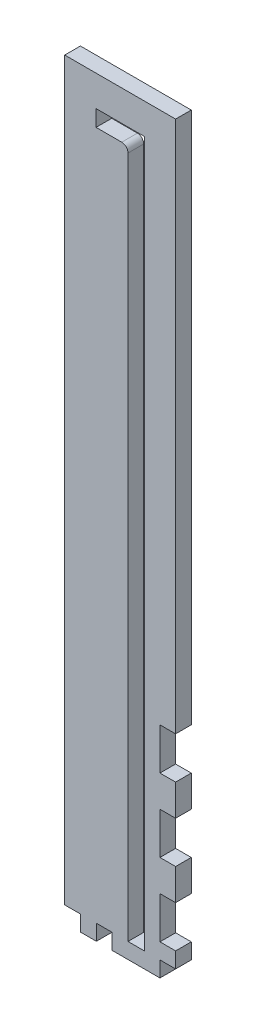
ISO-10303-21;
HEADER;
FILE_DESCRIPTION(('STEP AP214'),'2;1');
FILE_NAME('part.step','',(''),(''),'','','');
FILE_SCHEMA(('AUTOMOTIVE_DESIGN { 1 0 10303 214 1 1 1 1 }'));
ENDSEC;
DATA;
#1=APPLICATION_CONTEXT('core data for automotive mechanical design processes');
#2=APPLICATION_PROTOCOL_DEFINITION('international standard','automotive_design',2000,#1);
#3=PRODUCT_CONTEXT('',#1,'mechanical');
#4=PRODUCT('Part','Part','',(#3));
#5=PRODUCT_RELATED_PRODUCT_CATEGORY('part','',(#4));
#6=PRODUCT_DEFINITION_FORMATION('','',#4);
#7=PRODUCT_DEFINITION_CONTEXT('part definition',#1,'design');
#8=PRODUCT_DEFINITION('design','',#6,#7);
#9=PRODUCT_DEFINITION_SHAPE('','',#8);
#10=(LENGTH_UNIT() NAMED_UNIT(*) SI_UNIT(.MILLI.,.METRE.));
#11=(NAMED_UNIT(*) PLANE_ANGLE_UNIT() SI_UNIT($,.RADIAN.));
#12=(NAMED_UNIT(*) SI_UNIT($,.STERADIAN.) SOLID_ANGLE_UNIT());
#13=UNCERTAINTY_MEASURE_WITH_UNIT(LENGTH_MEASURE(1.E-05),#10,'distance_accuracy_value','');
#14=(GEOMETRIC_REPRESENTATION_CONTEXT(3) GLOBAL_UNCERTAINTY_ASSIGNED_CONTEXT((#13)) GLOBAL_UNIT_ASSIGNED_CONTEXT((#10,
#11,#12)) REPRESENTATION_CONTEXT('',''));
#15=CARTESIAN_POINT('',(0.,0.,0.));
#16=DIRECTION('',(0.,0.,1.));
#17=DIRECTION('',(1.,0.,0.));
#18=AXIS2_PLACEMENT_3D('',#15,#16,#17);
#19=CARTESIAN_POINT('',(16.0019999999999,155.448,6.35));
#20=DIRECTION('',(-1.,0.,0.));
#21=DIRECTION('',(0.,-1.,0.));
#22=AXIS2_PLACEMENT_3D('',#19,#20,#21);
#23=PLANE('',#22);
#24=DIRECTION('',(0.,1.,0.));
#25=VECTOR('',#24,1.);
#26=CARTESIAN_POINT('',(16.0019999999999,155.448,0.));
#27=LINE('',#26,#25);
#28=CARTESIAN_POINT('',(16.0019999999999,-90.0853333333333,0.));
#29=VERTEX_POINT('',#28);
#30=CARTESIAN_POINT('',(16.0019999999999,-77.3853333333333,0.));
#31=VERTEX_POINT('',#30);
#32=EDGE_CURVE('E482',#29,#31,#27,.T.);
#33=ORIENTED_EDGE('',*,*,#32,.T.);
#34=DIRECTION('',(0.,0.,1.));
#35=VECTOR('',#34,1.);
#36=CARTESIAN_POINT('',(16.0019999999999,-77.3853333333333,0.));
#37=LINE('',#36,#35);
#38=CARTESIAN_POINT('',(16.0019999999999,-77.3853333333333,6.35));
#39=VERTEX_POINT('',#38);
#40=EDGE_CURVE('E268',#31,#39,#37,.T.);
#41=ORIENTED_EDGE('',*,*,#40,.T.);
#42=DIRECTION('',(0.,1.,0.));
#43=VECTOR('',#42,1.);
#44=CARTESIAN_POINT('',(16.0019999999999,155.448,6.35));
#45=LINE('',#44,#43);
#46=CARTESIAN_POINT('',(16.0019999999999,-90.0853333333334,6.35));
#47=VERTEX_POINT('',#46);
#48=EDGE_CURVE('E502',#47,#39,#45,.T.);
#49=ORIENTED_EDGE('',*,*,#48,.F.);
#50=DIRECTION('',(0.,0.,1.));
#51=VECTOR('',#50,1.);
#52=CARTESIAN_POINT('',(16.0019999999999,-90.0853333333334,0.));
#53=LINE('',#52,#51);
#54=EDGE_CURVE('E282',#29,#47,#53,.T.);
#55=ORIENTED_EDGE('',*,*,#54,.F.);
#56=EDGE_LOOP('',(#33,#41,#49,#55));
#57=FACE_BOUND('',#56,.T.);
#58=ADVANCED_FACE('F35',(#57),#23,.F.);
#59=CARTESIAN_POINT('',(16.0019999999999,-119.718666666667,0.));
#60=VERTEX_POINT('',#59);
#61=CARTESIAN_POINT('',(16.0019999999999,-107.018666666667,0.));
#62=VERTEX_POINT('',#61);
#63=EDGE_CURVE('E457',#60,#62,#27,.T.);
#64=ORIENTED_EDGE('',*,*,#63,.T.);
#65=DIRECTION('',(0.,0.,1.));
#66=VECTOR('',#65,1.);
#67=CARTESIAN_POINT('',(16.0019999999999,-107.018666666667,0.));
#68=LINE('',#67,#66);
#69=CARTESIAN_POINT('',(16.0019999999999,-107.018666666667,6.35));
#70=VERTEX_POINT('',#69);
#71=EDGE_CURVE('E266',#62,#70,#68,.T.);
#72=ORIENTED_EDGE('',*,*,#71,.T.);
#73=CARTESIAN_POINT('',(16.0019999999999,-119.718666666667,6.35));
#74=VERTEX_POINT('',#73);
#75=EDGE_CURVE('E449',#74,#70,#45,.T.);
#76=ORIENTED_EDGE('',*,*,#75,.F.);
#77=DIRECTION('',(0.,0.,1.));
#78=VECTOR('',#77,1.);
#79=CARTESIAN_POINT('',(16.0019999999999,-119.718666666667,0.));
#80=LINE('',#79,#78);
#81=EDGE_CURVE('E308',#60,#74,#80,.T.);
#82=ORIENTED_EDGE('',*,*,#81,.F.);
#83=EDGE_LOOP('',(#64,#72,#76,#82));
#84=FACE_BOUND('',#83,.T.);
#85=ADVANCED_FACE('F490',(#84),#23,.F.);
#86=CARTESIAN_POINT('',(16.0019999999999,-143.002,0.));
#87=VERTEX_POINT('',#86);
#88=CARTESIAN_POINT('',(16.0019999999999,-136.652,0.));
#89=VERTEX_POINT('',#88);
#90=EDGE_CURVE('E454',#87,#89,#27,.T.);
#91=ORIENTED_EDGE('',*,*,#90,.T.);
#92=DIRECTION('',(0.,0.,1.));
#93=VECTOR('',#92,1.);
#94=CARTESIAN_POINT('',(16.0019999999999,-136.652,0.));
#95=LINE('',#94,#93);
#96=CARTESIAN_POINT('',(16.0019999999999,-136.652,6.35));
#97=VERTEX_POINT('',#96);
#98=EDGE_CURVE('E287',#89,#97,#95,.T.);
#99=ORIENTED_EDGE('',*,*,#98,.T.);
#100=CARTESIAN_POINT('',(16.0019999999999,-143.002,6.35));
#101=VERTEX_POINT('',#100);
#102=EDGE_CURVE('E445',#101,#97,#45,.T.);
#103=ORIENTED_EDGE('',*,*,#102,.F.);
#104=DIRECTION('',(0.,0.,1.));
#105=VECTOR('',#104,1.);
#106=CARTESIAN_POINT('',(16.0019999999999,-143.002,0.));
#107=LINE('',#106,#105);
#108=EDGE_CURVE('E329',#87,#101,#107,.T.);
#109=ORIENTED_EDGE('',*,*,#108,.F.);
#110=EDGE_LOOP('',(#91,#99,#103,#109));
#111=FACE_BOUND('',#110,.T.);
#112=ADVANCED_FACE('F537',(#111),#23,.F.);
#113=CARTESIAN_POINT('',(0.,0.,0.));
#114=DIRECTION('',(0.,0.,1.));
#115=DIRECTION('',(1.,0.,0.));
#116=AXIS2_PLACEMENT_3D('',#113,#114,#115);
#117=PLANE('',#116);
#118=DIRECTION('',(0.,1.,0.));
#119=VECTOR('',#118,1.);
#120=CARTESIAN_POINT('',(3.30199999999998,143.002,0.));
#121=LINE('',#120,#119);
#122=CARTESIAN_POINT('',(3.30200000000003,-143.002,0.));
#123=VERTEX_POINT('',#122);
#124=CARTESIAN_POINT('',(3.30199999999998,143.002,0.));
#125=VERTEX_POINT('',#124);
#126=EDGE_CURVE('E405',#123,#125,#121,.T.);
#127=ORIENTED_EDGE('',*,*,#126,.T.);
#128=DIRECTION('',(-1.,0.,0.));
#129=VECTOR('',#128,1.);
#130=CARTESIAN_POINT('',(3.30199999999998,143.002,0.));
#131=LINE('',#130,#129);
#132=CARTESIAN_POINT('',(-16.2560000000001,143.002,0.));
#133=VERTEX_POINT('',#132);
#134=EDGE_CURVE('E407',#125,#133,#131,.T.);
#135=ORIENTED_EDGE('',*,*,#134,.T.);
#136=DIRECTION('',(0.,-1.,0.));
#137=VECTOR('',#136,1.);
#138=CARTESIAN_POINT('',(-16.2560000000001,143.002,0.));
#139=LINE('',#138,#137);
#140=CARTESIAN_POINT('',(-16.2560000000001,136.398,0.));
#141=VERTEX_POINT('',#140);
#142=EDGE_CURVE('E410',#133,#141,#139,.T.);
#143=ORIENTED_EDGE('',*,*,#142,.T.);
#144=DIRECTION('',(1.,0.,0.));
#145=VECTOR('',#144,1.);
#146=CARTESIAN_POINT('',(-5.84200000000011,136.398,0.));
#147=LINE('',#146,#145);
#148=CARTESIAN_POINT('',(-5.84200000000011,136.398,0.));
#149=VERTEX_POINT('',#148);
#150=EDGE_CURVE('E413',#141,#149,#147,.T.);
#151=ORIENTED_EDGE('',*,*,#150,.T.);
#152=CARTESIAN_POINT('',(-5.84200000000011,133.858,0.));
#153=DIRECTION('',(0.,0.,-1.));
#154=DIRECTION('',(1.,0.,0.));
#155=AXIS2_PLACEMENT_3D('',#152,#153,#154);
#156=CIRCLE('',#155,2.53999999999999);
#157=CARTESIAN_POINT('',(-3.30200000000011,133.858,0.));
#158=VERTEX_POINT('',#157);
#159=EDGE_CURVE('E416',#149,#158,#156,.T.);
#160=ORIENTED_EDGE('',*,*,#159,.T.);
#161=DIRECTION('',(0.,-1.,0.));
#162=VECTOR('',#161,1.);
#163=CARTESIAN_POINT('',(-3.30200000000011,133.858,0.));
#164=LINE('',#163,#162);
#165=CARTESIAN_POINT('',(-3.30200000000011,-143.002,0.));
#166=VERTEX_POINT('',#165);
#167=EDGE_CURVE('E391',#158,#166,#164,.T.);
#168=ORIENTED_EDGE('',*,*,#167,.T.);
#169=DIRECTION('',(1.,0.,0.));
#170=VECTOR('',#169,1.);
#171=CARTESIAN_POINT('',(-3.30200000000011,-143.002,0.));
#172=LINE('',#171,#170);
#173=EDGE_CURVE('E375',#166,#123,#172,.T.);
#174=ORIENTED_EDGE('',*,*,#173,.T.);
#175=EDGE_LOOP('',(#127,#135,#143,#151,#160,#168,#174));
#176=FACE_BOUND('',#175,.T.);
#177=DIRECTION('',(0.,-1.,0.));
#178=VECTOR('',#177,1.);
#179=CARTESIAN_POINT('',(9.6519999999999,-60.452,0.));
#180=LINE('',#179,#178);
#181=CARTESIAN_POINT('',(9.6519999999999,-60.452,0.));
#182=VERTEX_POINT('',#181);
#183=CARTESIAN_POINT('',(9.6519999999999,-77.3853333333333,0.));
#184=VERTEX_POINT('',#183);
#185=EDGE_CURVE('E248',#182,#184,#180,.T.);
#186=ORIENTED_EDGE('',*,*,#185,.T.);
#187=DIRECTION('',(1.,0.,0.));
#188=VECTOR('',#187,1.);
#189=CARTESIAN_POINT('',(16.0019999999999,-77.3853333333333,0.));
#190=LINE('',#189,#188);
#191=EDGE_CURVE('E253',#184,#31,#190,.T.);
#192=ORIENTED_EDGE('',*,*,#191,.T.);
#193=ORIENTED_EDGE('',*,*,#32,.F.);
#194=DIRECTION('',(-1.,0.,0.));
#195=VECTOR('',#194,1.);
#196=CARTESIAN_POINT('',(16.0019999999999,-90.0853333333334,0.));
#197=LINE('',#196,#195);
#198=CARTESIAN_POINT('',(9.65199999999989,-90.0853333333334,0.));
#199=VERTEX_POINT('',#198);
#200=EDGE_CURVE('E58',#29,#199,#197,.T.);
#201=ORIENTED_EDGE('',*,*,#200,.T.);
#202=DIRECTION('',(0.,-1.,0.));
#203=VECTOR('',#202,1.);
#204=CARTESIAN_POINT('',(9.65199999999989,-90.0853333333334,0.));
#205=LINE('',#204,#203);
#206=CARTESIAN_POINT('',(9.65199999999989,-107.018666666667,0.));
#207=VERTEX_POINT('',#206);
#208=EDGE_CURVE('E275',#199,#207,#205,.T.);
#209=ORIENTED_EDGE('',*,*,#208,.T.);
#210=DIRECTION('',(1.,0.,0.));
#211=VECTOR('',#210,1.);
#212=CARTESIAN_POINT('',(16.0019999999999,-107.018666666667,0.));
#213=LINE('',#212,#211);
#214=EDGE_CURVE('E279',#207,#62,#213,.T.);
#215=ORIENTED_EDGE('',*,*,#214,.T.);
#216=ORIENTED_EDGE('',*,*,#63,.F.);
#217=DIRECTION('',(-1.,0.,0.));
#218=VECTOR('',#217,1.);
#219=CARTESIAN_POINT('',(16.0019999999999,-119.718666666667,0.));
#220=LINE('',#219,#218);
#221=CARTESIAN_POINT('',(9.65199999999989,-119.718666666667,0.));
#222=VERTEX_POINT('',#221);
#223=EDGE_CURVE('E298',#60,#222,#220,.T.);
#224=ORIENTED_EDGE('',*,*,#223,.T.);
#225=DIRECTION('',(0.,-1.,0.));
#226=VECTOR('',#225,1.);
#227=CARTESIAN_POINT('',(9.65199999999989,-119.718666666667,0.));
#228=LINE('',#227,#226);
#229=CARTESIAN_POINT('',(9.65199999999989,-136.652,0.));
#230=VERTEX_POINT('',#229);
#231=EDGE_CURVE('E301',#222,#230,#228,.T.);
#232=ORIENTED_EDGE('',*,*,#231,.T.);
#233=DIRECTION('',(1.,0.,0.));
#234=VECTOR('',#233,1.);
#235=CARTESIAN_POINT('',(16.0019999999999,-136.652,0.));
#236=LINE('',#235,#234);
#237=EDGE_CURVE('E305',#230,#89,#236,.T.);
#238=ORIENTED_EDGE('',*,*,#237,.T.);
#239=ORIENTED_EDGE('',*,*,#90,.F.);
#240=DIRECTION('',(1.,0.,0.));
#241=VECTOR('',#240,1.);
#242=CARTESIAN_POINT('',(0.,-143.002,0.));
#243=LINE('',#242,#241);
#244=CARTESIAN_POINT('',(9.65199999999917,-143.002,0.));
#245=VERTEX_POINT('',#244);
#246=EDGE_CURVE('E326',#245,#87,#243,.T.);
#247=ORIENTED_EDGE('',*,*,#246,.F.);
#248=DIRECTION('',(0.,-1.,0.));
#249=VECTOR('',#248,1.);
#250=CARTESIAN_POINT('',(9.65199999999917,-143.002,0.));
#251=LINE('',#250,#249);
#252=CARTESIAN_POINT('',(9.65199999999917,-149.352,0.));
#253=VERTEX_POINT('',#252);
#254=EDGE_CURVE('E334',#245,#253,#251,.T.);
#255=ORIENTED_EDGE('',*,*,#254,.T.);
#256=DIRECTION('',(1.,0.,0.));
#257=VECTOR('',#256,1.);
#258=CARTESIAN_POINT('',(-28.9560000000001,-149.352,0.));
#259=LINE('',#258,#257);
#260=CARTESIAN_POINT('',(-9.77900000000009,-149.352,0.));
#261=VERTEX_POINT('',#260);
#262=EDGE_CURVE('E384',#261,#253,#259,.T.);
#263=ORIENTED_EDGE('',*,*,#262,.F.);
#264=DIRECTION('',(0.,-1.,0.));
#265=VECTOR('',#264,1.);
#266=CARTESIAN_POINT('',(-9.77900000000009,-143.002,0.));
#267=LINE('',#266,#265);
#268=CARTESIAN_POINT('',(-9.77900000000009,-143.002,0.));
#269=VERTEX_POINT('',#268);
#270=EDGE_CURVE('E379',#269,#261,#267,.T.);
#271=ORIENTED_EDGE('',*,*,#270,.F.);
#272=DIRECTION('',(1.,0.,0.));
#273=VECTOR('',#272,1.);
#274=CARTESIAN_POINT('',(0.,-143.002,0.));
#275=LINE('',#274,#273);
#276=CARTESIAN_POINT('',(-16.1290000000001,-143.002,0.));
#277=VERTEX_POINT('',#276);
#278=EDGE_CURVE('E359',#277,#269,#275,.T.);
#279=ORIENTED_EDGE('',*,*,#278,.F.);
#280=DIRECTION('',(0.,-1.,0.));
#281=VECTOR('',#280,1.);
#282=CARTESIAN_POINT('',(-16.1290000000001,-143.002,0.));
#283=LINE('',#282,#281);
#284=CARTESIAN_POINT('',(-16.1290000000001,-149.352,0.));
#285=VERTEX_POINT('',#284);
#286=EDGE_CURVE('E369',#277,#285,#283,.T.);
#287=ORIENTED_EDGE('',*,*,#286,.T.);
#288=CARTESIAN_POINT('',(-22.6060000000001,-149.352,0.));
#289=VERTEX_POINT('',#288);
#290=EDGE_CURVE('E387',#289,#285,#259,.T.);
#291=ORIENTED_EDGE('',*,*,#290,.F.);
#292=DIRECTION('',(0.,-1.,0.));
#293=VECTOR('',#292,1.);
#294=CARTESIAN_POINT('',(-22.6060000000001,-143.002,0.));
#295=LINE('',#294,#293);
#296=CARTESIAN_POINT('',(-22.6060000000001,-143.002,0.));
#297=VERTEX_POINT('',#296);
#298=EDGE_CURVE('E351',#297,#289,#295,.T.);
#299=ORIENTED_EDGE('',*,*,#298,.F.);
#300=DIRECTION('',(1.,0.,0.));
#301=VECTOR('',#300,1.);
#302=CARTESIAN_POINT('',(0.,-143.002,0.));
#303=LINE('',#302,#301);
#304=CARTESIAN_POINT('',(-28.9560000000001,-143.002,0.));
#305=VERTEX_POINT('',#304);
#306=EDGE_CURVE('E344',#305,#297,#303,.T.);
#307=ORIENTED_EDGE('',*,*,#306,.F.);
#308=DIRECTION('',(0.,-1.,0.));
#309=VECTOR('',#308,1.);
#310=CARTESIAN_POINT('',(-28.9560000000001,155.448,0.));
#311=LINE('',#310,#309);
#312=CARTESIAN_POINT('',(-28.9560000000001,155.448,0.));
#313=VERTEX_POINT('',#312);
#314=EDGE_CURVE('E436',#313,#305,#311,.T.);
#315=ORIENTED_EDGE('',*,*,#314,.F.);
#316=DIRECTION('',(-1.,0.,0.));
#317=VECTOR('',#316,1.);
#318=CARTESIAN_POINT('',(-28.9560000000001,155.448,0.));
#319=LINE('',#318,#317);
#320=CARTESIAN_POINT('',(16.0019999999999,155.448,0.));
#321=VERTEX_POINT('',#320);
#322=EDGE_CURVE('E441',#321,#313,#319,.T.);
#323=ORIENTED_EDGE('',*,*,#322,.F.);
#324=CARTESIAN_POINT('',(16.0019999999999,-60.4519999999999,0.));
#325=VERTEX_POINT('',#324);
#326=EDGE_CURVE('E258',#325,#321,#27,.T.);
#327=ORIENTED_EDGE('',*,*,#326,.F.);
#328=DIRECTION('',(-1.,0.,0.));
#329=VECTOR('',#328,1.);
#330=CARTESIAN_POINT('',(16.0019999999999,-60.452,0.));
#331=LINE('',#330,#329);
#332=EDGE_CURVE('E50',#325,#182,#331,.T.);
#333=ORIENTED_EDGE('',*,*,#332,.T.);
#334=EDGE_LOOP('',(#186,#192,#193,#201,#209,#215,#216,#224,#232,#238,#239,#247,#255,#263,#271,
#279,#287,#291,#299,#307,#315,#323,#327,#333));
#335=FACE_BOUND('',#334,.T.);
#336=ADVANCED_FACE('F256',(#176,#335),#117,.F.);
#337=CARTESIAN_POINT('',(0.,0.,6.35));
#338=DIRECTION('',(0.,0.,1.));
#339=DIRECTION('',(1.,0.,0.));
#340=AXIS2_PLACEMENT_3D('',#337,#338,#339);
#341=PLANE('',#340);
#342=DIRECTION('',(1.,0.,0.));
#343=VECTOR('',#342,1.);
#344=CARTESIAN_POINT('',(16.0019999999999,-77.3853333333333,6.35));
#345=LINE('',#344,#343);
#346=CARTESIAN_POINT('',(9.6519999999999,-77.3853333333333,6.35));
#347=VERTEX_POINT('',#346);
#348=EDGE_CURVE('E259',#347,#39,#345,.T.);
#349=ORIENTED_EDGE('',*,*,#348,.F.);
#350=DIRECTION('',(0.,-1.,0.));
#351=VECTOR('',#350,1.);
#352=CARTESIAN_POINT('',(9.6519999999999,-60.452,6.35));
#353=LINE('',#352,#351);
#354=CARTESIAN_POINT('',(9.6519999999999,-60.452,6.35));
#355=VERTEX_POINT('',#354);
#356=EDGE_CURVE('E261',#355,#347,#353,.T.);
#357=ORIENTED_EDGE('',*,*,#356,.F.);
#358=DIRECTION('',(-1.,0.,0.));
#359=VECTOR('',#358,1.);
#360=CARTESIAN_POINT('',(16.0019999999999,-60.452,6.35));
#361=LINE('',#360,#359);
#362=CARTESIAN_POINT('',(16.0019999999999,-60.452,6.35));
#363=VERTEX_POINT('',#362);
#364=EDGE_CURVE('E240',#363,#355,#361,.T.);
#365=ORIENTED_EDGE('',*,*,#364,.F.);
#366=CARTESIAN_POINT('',(16.0019999999999,155.448,6.35));
#367=VERTEX_POINT('',#366);
#368=EDGE_CURVE('E450',#363,#367,#45,.T.);
#369=ORIENTED_EDGE('',*,*,#368,.T.);
#370=DIRECTION('',(-1.,0.,0.));
#371=VECTOR('',#370,1.);
#372=CARTESIAN_POINT('',(-28.9560000000001,155.448,6.35));
#373=LINE('',#372,#371);
#374=CARTESIAN_POINT('',(-28.9560000000001,155.448,6.35));
#375=VERTEX_POINT('',#374);
#376=EDGE_CURVE('E448',#367,#375,#373,.T.);
#377=ORIENTED_EDGE('',*,*,#376,.T.);
#378=DIRECTION('',(0.,-1.,0.));
#379=VECTOR('',#378,1.);
#380=CARTESIAN_POINT('',(-28.9560000000001,155.448,6.35));
#381=LINE('',#380,#379);
#382=CARTESIAN_POINT('',(-28.9560000000001,-143.002,6.35));
#383=VERTEX_POINT('',#382);
#384=EDGE_CURVE('E437',#375,#383,#381,.T.);
#385=ORIENTED_EDGE('',*,*,#384,.T.);
#386=DIRECTION('',(-1.,0.,0.));
#387=VECTOR('',#386,1.);
#388=CARTESIAN_POINT('',(0.,-143.002,6.35));
#389=LINE('',#388,#387);
#390=CARTESIAN_POINT('',(-22.6059999999998,-143.002,6.35));
#391=VERTEX_POINT('',#390);
#392=EDGE_CURVE('E349',#391,#383,#389,.T.);
#393=ORIENTED_EDGE('',*,*,#392,.F.);
#394=DIRECTION('',(0.,-1.,0.));
#395=VECTOR('',#394,1.);
#396=CARTESIAN_POINT('',(-22.6059999999998,-143.002,6.35));
#397=LINE('',#396,#395);
#398=CARTESIAN_POINT('',(-22.6059999999998,-149.352,6.35));
#399=VERTEX_POINT('',#398);
#400=EDGE_CURVE('E336',#391,#399,#397,.T.);
#401=ORIENTED_EDGE('',*,*,#400,.T.);
#402=DIRECTION('',(1.,0.,0.));
#403=VECTOR('',#402,1.);
#404=CARTESIAN_POINT('',(-28.9560000000001,-149.352,6.35));
#405=LINE('',#404,#403);
#406=CARTESIAN_POINT('',(-16.1290000000001,-149.352,6.35));
#407=VERTEX_POINT('',#406);
#408=EDGE_CURVE('E444',#399,#407,#405,.T.);
#409=ORIENTED_EDGE('',*,*,#408,.T.);
#410=DIRECTION('',(0.,-1.,0.));
#411=VECTOR('',#410,1.);
#412=CARTESIAN_POINT('',(-16.1290000000001,-143.002,6.35));
#413=LINE('',#412,#411);
#414=CARTESIAN_POINT('',(-16.1290000000001,-143.002,6.35));
#415=VERTEX_POINT('',#414);
#416=EDGE_CURVE('E373',#415,#407,#413,.T.);
#417=ORIENTED_EDGE('',*,*,#416,.F.);
#418=DIRECTION('',(-1.,0.,0.));
#419=VECTOR('',#418,1.);
#420=CARTESIAN_POINT('',(0.,-143.002,6.35));
#421=LINE('',#420,#419);
#422=CARTESIAN_POINT('',(-9.77900000000009,-143.002,6.35));
#423=VERTEX_POINT('',#422);
#424=EDGE_CURVE('E366',#423,#415,#421,.T.);
#425=ORIENTED_EDGE('',*,*,#424,.F.);
#426=DIRECTION('',(0.,-1.,0.));
#427=VECTOR('',#426,1.);
#428=CARTESIAN_POINT('',(-9.77900000000009,-143.002,6.35));
#429=LINE('',#428,#427);
#430=CARTESIAN_POINT('',(-9.77900000000009,-149.352,6.35));
#431=VERTEX_POINT('',#430);
#432=EDGE_CURVE('E376',#423,#431,#429,.T.);
#433=ORIENTED_EDGE('',*,*,#432,.T.);
#434=CARTESIAN_POINT('',(9.65199999999993,-149.352,6.35));
#435=VERTEX_POINT('',#434);
#436=EDGE_CURVE('E440',#431,#435,#405,.T.);
#437=ORIENTED_EDGE('',*,*,#436,.T.);
#438=DIRECTION('',(0.,-1.,0.));
#439=VECTOR('',#438,1.);
#440=CARTESIAN_POINT('',(9.65199999999993,-143.002,6.35));
#441=LINE('',#440,#439);
#442=CARTESIAN_POINT('',(9.65199999999993,-143.002,6.35));
#443=VERTEX_POINT('',#442);
#444=EDGE_CURVE('E337',#443,#435,#441,.T.);
#445=ORIENTED_EDGE('',*,*,#444,.F.);
#446=DIRECTION('',(-1.,0.,0.));
#447=VECTOR('',#446,1.);
#448=CARTESIAN_POINT('',(0.,-143.002,6.35));
#449=LINE('',#448,#447);
#450=EDGE_CURVE('E331',#101,#443,#449,.T.);
#451=ORIENTED_EDGE('',*,*,#450,.F.);
#452=ORIENTED_EDGE('',*,*,#102,.T.);
#453=DIRECTION('',(1.,0.,0.));
#454=VECTOR('',#453,1.);
#455=CARTESIAN_POINT('',(16.0019999999999,-136.652,6.35));
#456=LINE('',#455,#454);
#457=CARTESIAN_POINT('',(9.65199999999989,-136.652,6.35));
#458=VERTEX_POINT('',#457);
#459=EDGE_CURVE('E302',#458,#97,#456,.T.);
#460=ORIENTED_EDGE('',*,*,#459,.F.);
#461=DIRECTION('',(0.,-1.,0.));
#462=VECTOR('',#461,1.);
#463=CARTESIAN_POINT('',(9.65199999999989,-119.718666666667,6.35));
#464=LINE('',#463,#462);
#465=CARTESIAN_POINT('',(9.65199999999989,-119.718666666667,6.35));
#466=VERTEX_POINT('',#465);
#467=EDGE_CURVE('E312',#466,#458,#464,.T.);
#468=ORIENTED_EDGE('',*,*,#467,.F.);
#469=DIRECTION('',(-1.,0.,0.));
#470=VECTOR('',#469,1.);
#471=CARTESIAN_POINT('',(16.0019999999999,-119.718666666667,6.35));
#472=LINE('',#471,#470);
#473=EDGE_CURVE('E309',#74,#466,#472,.T.);
#474=ORIENTED_EDGE('',*,*,#473,.F.);
#475=ORIENTED_EDGE('',*,*,#75,.T.);
#476=DIRECTION('',(1.,0.,0.));
#477=VECTOR('',#476,1.);
#478=CARTESIAN_POINT('',(16.0019999999999,-107.018666666667,6.35));
#479=LINE('',#478,#477);
#480=CARTESIAN_POINT('',(9.65199999999989,-107.018666666667,6.35));
#481=VERTEX_POINT('',#480);
#482=EDGE_CURVE('E276',#481,#70,#479,.T.);
#483=ORIENTED_EDGE('',*,*,#482,.F.);
#484=DIRECTION('',(0.,-1.,0.));
#485=VECTOR('',#484,1.);
#486=CARTESIAN_POINT('',(9.65199999999989,-90.0853333333334,6.35));
#487=LINE('',#486,#485);
#488=CARTESIAN_POINT('',(9.65199999999989,-90.0853333333334,6.35));
#489=VERTEX_POINT('',#488);
#490=EDGE_CURVE('E286',#489,#481,#487,.T.);
#491=ORIENTED_EDGE('',*,*,#490,.F.);
#492=DIRECTION('',(-1.,0.,0.));
#493=VECTOR('',#492,1.);
#494=CARTESIAN_POINT('',(16.0019999999999,-90.0853333333334,6.35));
#495=LINE('',#494,#493);
#496=EDGE_CURVE('E283',#47,#489,#495,.T.);
#497=ORIENTED_EDGE('',*,*,#496,.F.);
#498=ORIENTED_EDGE('',*,*,#48,.T.);
#499=EDGE_LOOP('',(#349,#357,#365,#369,#377,#385,#393,#401,#409,#417,#425,#433,#437,#445,#451,
#452,#460,#468,#474,#475,#483,#491,#497,#498));
#500=FACE_BOUND('',#499,.T.);
#501=DIRECTION('',(-1.,0.,0.));
#502=VECTOR('',#501,1.);
#503=CARTESIAN_POINT('',(3.30199999999998,143.002,6.35));
#504=LINE('',#503,#502);
#505=CARTESIAN_POINT('',(3.30199999999998,143.002,6.35));
#506=VERTEX_POINT('',#505);
#507=CARTESIAN_POINT('',(-16.2560000000001,143.002,6.35));
#508=VERTEX_POINT('',#507);
#509=EDGE_CURVE('E390',#506,#508,#504,.T.);
#510=ORIENTED_EDGE('',*,*,#509,.F.);
#511=DIRECTION('',(0.,1.,0.));
#512=VECTOR('',#511,1.);
#513=CARTESIAN_POINT('',(3.30199999999998,143.002,6.35));
#514=LINE('',#513,#512);
#515=CARTESIAN_POINT('',(3.30200000000003,-143.002,6.35));
#516=VERTEX_POINT('',#515);
#517=EDGE_CURVE('E388',#516,#506,#514,.T.);
#518=ORIENTED_EDGE('',*,*,#517,.F.);
#519=DIRECTION('',(1.,0.,0.));
#520=VECTOR('',#519,1.);
#521=CARTESIAN_POINT('',(-3.30200000000011,-143.002,6.35));
#522=LINE('',#521,#520);
#523=CARTESIAN_POINT('',(-3.30200000000011,-143.002,6.35));
#524=VERTEX_POINT('',#523);
#525=EDGE_CURVE('E402',#524,#516,#522,.T.);
#526=ORIENTED_EDGE('',*,*,#525,.F.);
#527=DIRECTION('',(0.,-1.,0.));
#528=VECTOR('',#527,1.);
#529=CARTESIAN_POINT('',(-3.30200000000011,133.858,6.35));
#530=LINE('',#529,#528);
#531=CARTESIAN_POINT('',(-3.30200000000011,133.858,6.35));
#532=VERTEX_POINT('',#531);
#533=EDGE_CURVE('E399',#532,#524,#530,.T.);
#534=ORIENTED_EDGE('',*,*,#533,.F.);
#535=CARTESIAN_POINT('',(-5.84200000000011,133.858,6.35));
#536=DIRECTION('',(0.,0.,-1.));
#537=DIRECTION('',(1.,0.,0.));
#538=AXIS2_PLACEMENT_3D('',#535,#536,#537);
#539=CIRCLE('',#538,2.53999999999999);
#540=CARTESIAN_POINT('',(-5.84200000000011,136.398,6.35));
#541=VERTEX_POINT('',#540);
#542=EDGE_CURVE('E397',#541,#532,#539,.T.);
#543=ORIENTED_EDGE('',*,*,#542,.F.);
#544=DIRECTION('',(1.,0.,0.));
#545=VECTOR('',#544,1.);
#546=CARTESIAN_POINT('',(-5.84200000000011,136.398,6.35));
#547=LINE('',#546,#545);
#548=CARTESIAN_POINT('',(-16.2560000000001,136.398,6.35));
#549=VERTEX_POINT('',#548);
#550=EDGE_CURVE('E395',#549,#541,#547,.T.);
#551=ORIENTED_EDGE('',*,*,#550,.F.);
#552=DIRECTION('',(0.,-1.,0.));
#553=VECTOR('',#552,1.);
#554=CARTESIAN_POINT('',(-16.2560000000001,143.002,6.35));
#555=LINE('',#554,#553);
#556=EDGE_CURVE('E393',#508,#549,#555,.T.);
#557=ORIENTED_EDGE('',*,*,#556,.F.);
#558=EDGE_LOOP('',(#510,#518,#526,#534,#543,#551,#557));
#559=FACE_BOUND('',#558,.T.);
#560=ADVANCED_FACE('F475',(#500,#559),#341,.T.);
#561=CARTESIAN_POINT('',(-28.9560000000001,155.448,6.35));
#562=DIRECTION('',(1.,0.,0.));
#563=DIRECTION('',(0.,1.,0.));
#564=AXIS2_PLACEMENT_3D('',#561,#562,#563);
#565=PLANE('',#564);
#566=DIRECTION('',(0.,0.,-1.));
#567=VECTOR('',#566,1.);
#568=CARTESIAN_POINT('',(-28.9560000000001,-143.002,0.));
#569=LINE('',#568,#567);
#570=EDGE_CURVE('E342',#383,#305,#569,.T.);
#571=ORIENTED_EDGE('',*,*,#570,.F.);
#572=ORIENTED_EDGE('',*,*,#384,.F.);
#573=DIRECTION('',(0.,0.,-1.));
#574=VECTOR('',#573,1.);
#575=CARTESIAN_POINT('',(-28.9560000000001,155.448,6.35));
#576=LINE('',#575,#574);
#577=EDGE_CURVE('E43',#375,#313,#576,.T.);
#578=ORIENTED_EDGE('',*,*,#577,.T.);
#579=ORIENTED_EDGE('',*,*,#314,.T.);
#580=EDGE_LOOP('',(#571,#572,#578,#579));
#581=FACE_BOUND('',#580,.T.);
#582=ADVANCED_FACE('F37',(#581),#565,.F.);
#583=CARTESIAN_POINT('',(-28.9560000000001,-149.352,6.35));
#584=DIRECTION('',(0.,1.,0.));
#585=DIRECTION('',(0.,0.,1.));
#586=AXIS2_PLACEMENT_3D('',#583,#584,#585);
#587=PLANE('',#586);
#588=DIRECTION('',(0.,0.,-1.));
#589=VECTOR('',#588,1.);
#590=CARTESIAN_POINT('',(-22.6060000000001,-149.352,0.));
#591=LINE('',#590,#589);
#592=EDGE_CURVE('E271',#399,#289,#591,.T.);
#593=ORIENTED_EDGE('',*,*,#592,.T.);
#594=ORIENTED_EDGE('',*,*,#290,.T.);
#595=DIRECTION('',(0.,0.,1.));
#596=VECTOR('',#595,1.);
#597=CARTESIAN_POINT('',(-16.1290000000001,-149.352,0.));
#598=LINE('',#597,#596);
#599=EDGE_CURVE('E339',#285,#407,#598,.T.);
#600=ORIENTED_EDGE('',*,*,#599,.T.);
#601=ORIENTED_EDGE('',*,*,#408,.F.);
#602=EDGE_LOOP('',(#593,#594,#600,#601));
#603=FACE_BOUND('',#602,.T.);
#604=ADVANCED_FACE('F510',(#603),#587,.F.);
#605=ORIENTED_EDGE('',*,*,#368,.F.);
#606=DIRECTION('',(0.,0.,1.));
#607=VECTOR('',#606,1.);
#608=CARTESIAN_POINT('',(16.0019999999999,-60.452,0.));
#609=LINE('',#608,#607);
#610=EDGE_CURVE('E245',#325,#363,#609,.T.);
#611=ORIENTED_EDGE('',*,*,#610,.F.);
#612=ORIENTED_EDGE('',*,*,#326,.T.);
#613=DIRECTION('',(0.,0.,-1.));
#614=VECTOR('',#613,1.);
#615=CARTESIAN_POINT('',(16.0019999999999,155.448,6.35));
#616=LINE('',#615,#614);
#617=EDGE_CURVE('E11',#367,#321,#616,.T.);
#618=ORIENTED_EDGE('',*,*,#617,.F.);
#619=EDGE_LOOP('',(#605,#611,#612,#618));
#620=FACE_BOUND('',#619,.T.);
#621=ADVANCED_FACE('F481',(#620),#23,.F.);
#622=ORIENTED_EDGE('',*,*,#262,.T.);
#623=DIRECTION('',(-1.19108572523762E-13,0.,-1.));
#624=VECTOR('',#623,1.);
#625=CARTESIAN_POINT('',(9.65199999999917,-149.352,-1.14963594199925E-12));
#626=LINE('',#625,#624);
#627=EDGE_CURVE('E327',#435,#253,#626,.T.);
#628=ORIENTED_EDGE('',*,*,#627,.F.);
#629=ORIENTED_EDGE('',*,*,#436,.F.);
#630=DIRECTION('',(0.,0.,1.));
#631=VECTOR('',#630,1.);
#632=CARTESIAN_POINT('',(-9.77900000000009,-149.352,0.));
#633=LINE('',#632,#631);
#634=EDGE_CURVE('E360',#261,#431,#633,.T.);
#635=ORIENTED_EDGE('',*,*,#634,.F.);
#636=EDGE_LOOP('',(#622,#628,#629,#635));
#637=FACE_BOUND('',#636,.T.);
#638=ADVANCED_FACE('F526',(#637),#587,.F.);
#639=CARTESIAN_POINT('',(-28.9560000000001,155.448,6.35));
#640=DIRECTION('',(0.,-1.,0.));
#641=DIRECTION('',(0.,0.,-1.));
#642=AXIS2_PLACEMENT_3D('',#639,#640,#641);
#643=PLANE('',#642);
#644=ORIENTED_EDGE('',*,*,#322,.T.);
#645=ORIENTED_EDGE('',*,*,#577,.F.);
#646=ORIENTED_EDGE('',*,*,#376,.F.);
#647=ORIENTED_EDGE('',*,*,#617,.T.);
#648=EDGE_LOOP('',(#644,#645,#646,#647));
#649=FACE_BOUND('',#648,.T.);
#650=ADVANCED_FACE('F479',(#649),#643,.F.);
#651=CARTESIAN_POINT('',(3.30199999999998,143.002,6.35));
#652=DIRECTION('',(-1.,0.,0.));
#653=DIRECTION('',(0.,-1.,0.));
#654=AXIS2_PLACEMENT_3D('',#651,#652,#653);
#655=PLANE('',#654);
#656=ORIENTED_EDGE('',*,*,#126,.F.);
#657=DIRECTION('',(0.,0.,-1.));
#658=VECTOR('',#657,1.);
#659=CARTESIAN_POINT('',(3.30200000000003,-143.002,6.35));
#660=LINE('',#659,#658);
#661=EDGE_CURVE('E404',#516,#123,#660,.T.);
#662=ORIENTED_EDGE('',*,*,#661,.F.);
#663=ORIENTED_EDGE('',*,*,#517,.T.);
#664=DIRECTION('',(0.,0.,-1.));
#665=VECTOR('',#664,1.);
#666=CARTESIAN_POINT('',(3.30199999999998,143.002,6.35));
#667=LINE('',#666,#665);
#668=EDGE_CURVE('E433',#506,#125,#667,.T.);
#669=ORIENTED_EDGE('',*,*,#668,.T.);
#670=EDGE_LOOP('',(#656,#662,#663,#669));
#671=FACE_BOUND('',#670,.T.);
#672=ADVANCED_FACE('F582',(#671),#655,.T.);
#673=CARTESIAN_POINT('',(3.30199999999998,143.002,6.35));
#674=DIRECTION('',(0.,-1.,0.));
#675=DIRECTION('',(0.,0.,-1.));
#676=AXIS2_PLACEMENT_3D('',#673,#674,#675);
#677=PLANE('',#676);
#678=ORIENTED_EDGE('',*,*,#134,.F.);
#679=ORIENTED_EDGE('',*,*,#668,.F.);
#680=ORIENTED_EDGE('',*,*,#509,.T.);
#681=DIRECTION('',(0.,0.,-1.));
#682=VECTOR('',#681,1.);
#683=CARTESIAN_POINT('',(-16.2560000000001,143.002,6.35));
#684=LINE('',#683,#682);
#685=EDGE_CURVE('E431',#508,#133,#684,.T.);
#686=ORIENTED_EDGE('',*,*,#685,.T.);
#687=EDGE_LOOP('',(#678,#679,#680,#686));
#688=FACE_BOUND('',#687,.T.);
#689=ADVANCED_FACE('F586',(#688),#677,.T.);
#690=CARTESIAN_POINT('',(-16.2560000000001,143.002,6.35));
#691=DIRECTION('',(1.,0.,0.));
#692=DIRECTION('',(0.,0.,-1.));
#693=AXIS2_PLACEMENT_3D('',#690,#691,#692);
#694=PLANE('',#693);
#695=ORIENTED_EDGE('',*,*,#142,.F.);
#696=ORIENTED_EDGE('',*,*,#685,.F.);
#697=ORIENTED_EDGE('',*,*,#556,.T.);
#698=DIRECTION('',(0.,0.,-1.));
#699=VECTOR('',#698,1.);
#700=CARTESIAN_POINT('',(-16.2560000000001,136.398,6.35));
#701=LINE('',#700,#699);
#702=EDGE_CURVE('E429',#549,#141,#701,.T.);
#703=ORIENTED_EDGE('',*,*,#702,.T.);
#704=EDGE_LOOP('',(#695,#696,#697,#703));
#705=FACE_BOUND('',#704,.T.);
#706=ADVANCED_FACE('F591',(#705),#694,.T.);
#707=CARTESIAN_POINT('',(-5.84200000000011,136.398,6.35));
#708=DIRECTION('',(0.,1.,0.));
#709=DIRECTION('',(0.,0.,1.));
#710=AXIS2_PLACEMENT_3D('',#707,#708,#709);
#711=PLANE('',#710);
#712=ORIENTED_EDGE('',*,*,#150,.F.);
#713=ORIENTED_EDGE('',*,*,#702,.F.);
#714=ORIENTED_EDGE('',*,*,#550,.T.);
#715=DIRECTION('',(0.,0.,-1.));
#716=VECTOR('',#715,1.);
#717=CARTESIAN_POINT('',(-5.84200000000011,136.398,6.35));
#718=LINE('',#717,#716);
#719=EDGE_CURVE('E427',#541,#149,#718,.T.);
#720=ORIENTED_EDGE('',*,*,#719,.T.);
#721=EDGE_LOOP('',(#712,#713,#714,#720));
#722=FACE_BOUND('',#721,.T.);
#723=ADVANCED_FACE('F598',(#722),#711,.T.);
#724=CARTESIAN_POINT('',(-5.84200000000011,133.858,6.35));
#725=DIRECTION('',(0.,0.,-1.));
#726=DIRECTION('',(-1.,0.,0.));
#727=AXIS2_PLACEMENT_3D('',#724,#725,#726);
#728=CYLINDRICAL_SURFACE('',#727,2.53999999999999);
#729=ORIENTED_EDGE('',*,*,#159,.F.);
#730=ORIENTED_EDGE('',*,*,#719,.F.);
#731=ORIENTED_EDGE('',*,*,#542,.T.);
#732=DIRECTION('',(0.,0.,-1.));
#733=VECTOR('',#732,1.);
#734=CARTESIAN_POINT('',(-3.30200000000011,133.858,6.35));
#735=LINE('',#734,#733);
#736=EDGE_CURVE('E425',#532,#158,#735,.T.);
#737=ORIENTED_EDGE('',*,*,#736,.T.);
#738=EDGE_LOOP('',(#729,#730,#731,#737));
#739=FACE_BOUND('',#738,.T.);
#740=ADVANCED_FACE('F602',(#739),#728,.T.);
#741=CARTESIAN_POINT('',(-3.30200000000011,133.858,6.35));
#742=DIRECTION('',(1.,0.,0.));
#743=DIRECTION('',(0.,0.,-1.));
#744=AXIS2_PLACEMENT_3D('',#741,#742,#743);
#745=PLANE('',#744);
#746=ORIENTED_EDGE('',*,*,#167,.F.);
#747=ORIENTED_EDGE('',*,*,#736,.F.);
#748=ORIENTED_EDGE('',*,*,#533,.T.);
#749=DIRECTION('',(0.,0.,-1.));
#750=VECTOR('',#749,1.);
#751=CARTESIAN_POINT('',(-3.30200000000011,-143.002,6.35));
#752=LINE('',#751,#750);
#753=EDGE_CURVE('E422',#524,#166,#752,.T.);
#754=ORIENTED_EDGE('',*,*,#753,.T.);
#755=EDGE_LOOP('',(#746,#747,#748,#754));
#756=FACE_BOUND('',#755,.T.);
#757=ADVANCED_FACE('F606',(#756),#745,.T.);
#758=CARTESIAN_POINT('',(-3.30200000000011,-143.002,6.35));
#759=DIRECTION('',(0.,1.,0.));
#760=DIRECTION('',(0.,0.,1.));
#761=AXIS2_PLACEMENT_3D('',#758,#759,#760);
#762=PLANE('',#761);
#763=ORIENTED_EDGE('',*,*,#173,.F.);
#764=ORIENTED_EDGE('',*,*,#753,.F.);
#765=ORIENTED_EDGE('',*,*,#525,.T.);
#766=ORIENTED_EDGE('',*,*,#661,.T.);
#767=EDGE_LOOP('',(#763,#764,#765,#766));
#768=FACE_BOUND('',#767,.T.);
#769=ADVANCED_FACE('F610',(#768),#762,.T.);
#770=CARTESIAN_POINT('',(9.65199999999917,-143.002,-1.14963594199925E-12));
#771=DIRECTION('',(-1.,0.,1.19108572523762E-13));
#772=DIRECTION('',(1.19108572523762E-13,0.,1.));
#773=AXIS2_PLACEMENT_3D('',#770,#771,#772);
#774=PLANE('',#773);
#775=ORIENTED_EDGE('',*,*,#627,.T.);
#776=ORIENTED_EDGE('',*,*,#254,.F.);
#777=DIRECTION('',(-1.19108572523762E-13,0.,-1.));
#778=VECTOR('',#777,1.);
#779=CARTESIAN_POINT('',(9.65199999999917,-143.002,-1.14963594199925E-12));
#780=LINE('',#779,#778);
#781=EDGE_CURVE('E323',#443,#245,#780,.T.);
#782=ORIENTED_EDGE('',*,*,#781,.F.);
#783=ORIENTED_EDGE('',*,*,#444,.T.);
#784=EDGE_LOOP('',(#775,#776,#782,#783));
#785=FACE_BOUND('',#784,.T.);
#786=ADVANCED_FACE('F528',(#785),#774,.F.);
#787=CARTESIAN_POINT('',(0.,-143.002,0.));
#788=DIRECTION('',(0.,-1.,0.));
#789=DIRECTION('',(0.,0.,-1.));
#790=AXIS2_PLACEMENT_3D('',#787,#788,#789);
#791=PLANE('',#790);
#792=ORIENTED_EDGE('',*,*,#781,.T.);
#793=ORIENTED_EDGE('',*,*,#246,.T.);
#794=ORIENTED_EDGE('',*,*,#108,.T.);
#795=ORIENTED_EDGE('',*,*,#450,.T.);
#796=EDGE_LOOP('',(#792,#793,#794,#795));
#797=FACE_BOUND('',#796,.T.);
#798=ADVANCED_FACE('F533',(#797),#791,.T.);
#799=CARTESIAN_POINT('',(-16.1290000000001,-143.002,0.));
#800=DIRECTION('',(1.,0.,0.));
#801=DIRECTION('',(0.,0.,-1.));
#802=AXIS2_PLACEMENT_3D('',#799,#800,#801);
#803=PLANE('',#802);
#804=ORIENTED_EDGE('',*,*,#599,.F.);
#805=ORIENTED_EDGE('',*,*,#286,.F.);
#806=DIRECTION('',(0.,0.,1.));
#807=VECTOR('',#806,1.);
#808=CARTESIAN_POINT('',(-16.1290000000001,-143.002,0.));
#809=LINE('',#808,#807);
#810=EDGE_CURVE('E357',#277,#415,#809,.T.);
#811=ORIENTED_EDGE('',*,*,#810,.T.);
#812=ORIENTED_EDGE('',*,*,#416,.T.);
#813=EDGE_LOOP('',(#804,#805,#811,#812));
#814=FACE_BOUND('',#813,.T.);
#815=ADVANCED_FACE('F513',(#814),#803,.T.);
#816=CARTESIAN_POINT('',(-9.77900000000009,-143.002,0.));
#817=DIRECTION('',(1.,0.,0.));
#818=DIRECTION('',(0.,0.,-1.));
#819=AXIS2_PLACEMENT_3D('',#816,#817,#818);
#820=PLANE('',#819);
#821=ORIENTED_EDGE('',*,*,#634,.T.);
#822=ORIENTED_EDGE('',*,*,#432,.F.);
#823=DIRECTION('',(0.,0.,1.));
#824=VECTOR('',#823,1.);
#825=CARTESIAN_POINT('',(-9.77900000000009,-143.002,0.));
#826=LINE('',#825,#824);
#827=EDGE_CURVE('E363',#269,#423,#826,.T.);
#828=ORIENTED_EDGE('',*,*,#827,.F.);
#829=ORIENTED_EDGE('',*,*,#270,.T.);
#830=EDGE_LOOP('',(#821,#822,#828,#829));
#831=FACE_BOUND('',#830,.T.);
#832=ADVANCED_FACE('F617',(#831),#820,.F.);
#833=CARTESIAN_POINT('',(0.,-143.002,0.));
#834=DIRECTION('',(0.,-1.,0.));
#835=DIRECTION('',(0.,0.,-1.));
#836=AXIS2_PLACEMENT_3D('',#833,#834,#835);
#837=PLANE('',#836);
#838=ORIENTED_EDGE('',*,*,#810,.F.);
#839=ORIENTED_EDGE('',*,*,#278,.T.);
#840=ORIENTED_EDGE('',*,*,#827,.T.);
#841=ORIENTED_EDGE('',*,*,#424,.T.);
#842=EDGE_LOOP('',(#838,#839,#840,#841));
#843=FACE_BOUND('',#842,.T.);
#844=ADVANCED_FACE('F519',(#843),#837,.T.);
#845=CARTESIAN_POINT('',(-22.6060000000001,-143.002,0.));
#846=DIRECTION('',(-1.,0.,0.));
#847=DIRECTION('',(0.,0.,1.));
#848=AXIS2_PLACEMENT_3D('',#845,#846,#847);
#849=PLANE('',#848);
#850=ORIENTED_EDGE('',*,*,#592,.F.);
#851=ORIENTED_EDGE('',*,*,#400,.F.);
#852=DIRECTION('',(0.,0.,-1.));
#853=VECTOR('',#852,1.);
#854=CARTESIAN_POINT('',(-22.6060000000001,-143.002,0.));
#855=LINE('',#854,#853);
#856=EDGE_CURVE('E347',#391,#297,#855,.T.);
#857=ORIENTED_EDGE('',*,*,#856,.T.);
#858=ORIENTED_EDGE('',*,*,#298,.T.);
#859=EDGE_LOOP('',(#850,#851,#857,#858));
#860=FACE_BOUND('',#859,.T.);
#861=ADVANCED_FACE('F622',(#860),#849,.T.);
#862=CARTESIAN_POINT('',(0.,-143.002,0.));
#863=DIRECTION('',(0.,-1.,0.));
#864=DIRECTION('',(0.,0.,-1.));
#865=AXIS2_PLACEMENT_3D('',#862,#863,#864);
#866=PLANE('',#865);
#867=ORIENTED_EDGE('',*,*,#570,.T.);
#868=ORIENTED_EDGE('',*,*,#306,.T.);
#869=ORIENTED_EDGE('',*,*,#856,.F.);
#870=ORIENTED_EDGE('',*,*,#392,.T.);
#871=EDGE_LOOP('',(#867,#868,#869,#870));
#872=FACE_BOUND('',#871,.T.);
#873=ADVANCED_FACE('F471',(#872),#866,.T.);
#874=CARTESIAN_POINT('',(16.0019999999999,-136.652,0.));
#875=DIRECTION('',(0.,-1.,0.));
#876=DIRECTION('',(0.,0.,-1.));
#877=AXIS2_PLACEMENT_3D('',#874,#875,#876);
#878=PLANE('',#877);
#879=ORIENTED_EDGE('',*,*,#459,.T.);
#880=ORIENTED_EDGE('',*,*,#98,.F.);
#881=ORIENTED_EDGE('',*,*,#237,.F.);
#882=DIRECTION('',(0.,0.,1.));
#883=VECTOR('',#882,1.);
#884=CARTESIAN_POINT('',(9.65199999999989,-136.652,0.));
#885=LINE('',#884,#883);
#886=EDGE_CURVE('E318',#230,#458,#885,.T.);
#887=ORIENTED_EDGE('',*,*,#886,.T.);
#888=EDGE_LOOP('',(#879,#880,#881,#887));
#889=FACE_BOUND('',#888,.T.);
#890=ADVANCED_FACE('F540',(#889),#878,.F.);
#891=CARTESIAN_POINT('',(9.65199999999989,-119.718666666667,0.));
#892=DIRECTION('',(-1.,0.,0.));
#893=DIRECTION('',(0.,0.,1.));
#894=AXIS2_PLACEMENT_3D('',#891,#892,#893);
#895=PLANE('',#894);
#896=ORIENTED_EDGE('',*,*,#467,.T.);
#897=ORIENTED_EDGE('',*,*,#886,.F.);
#898=ORIENTED_EDGE('',*,*,#231,.F.);
#899=DIRECTION('',(0.,0.,1.));
#900=VECTOR('',#899,1.);
#901=CARTESIAN_POINT('',(9.65199999999989,-119.718666666667,0.));
#902=LINE('',#901,#900);
#903=EDGE_CURVE('E320',#222,#466,#902,.T.);
#904=ORIENTED_EDGE('',*,*,#903,.T.);
#905=EDGE_LOOP('',(#896,#897,#898,#904));
#906=FACE_BOUND('',#905,.T.);
#907=ADVANCED_FACE('F544',(#906),#895,.F.);
#908=CARTESIAN_POINT('',(16.0019999999999,-119.718666666667,0.));
#909=DIRECTION('',(0.,1.,0.));
#910=DIRECTION('',(0.,0.,1.));
#911=AXIS2_PLACEMENT_3D('',#908,#909,#910);
#912=PLANE('',#911);
#913=ORIENTED_EDGE('',*,*,#473,.T.);
#914=ORIENTED_EDGE('',*,*,#903,.F.);
#915=ORIENTED_EDGE('',*,*,#223,.F.);
#916=ORIENTED_EDGE('',*,*,#81,.T.);
#917=EDGE_LOOP('',(#913,#914,#915,#916));
#918=FACE_BOUND('',#917,.T.);
#919=ADVANCED_FACE('F546',(#918),#912,.F.);
#920=CARTESIAN_POINT('',(16.0019999999999,-107.018666666667,0.));
#921=DIRECTION('',(0.,-1.,0.));
#922=DIRECTION('',(0.,0.,-1.));
#923=AXIS2_PLACEMENT_3D('',#920,#921,#922);
#924=PLANE('',#923);
#925=ORIENTED_EDGE('',*,*,#482,.T.);
#926=ORIENTED_EDGE('',*,*,#71,.F.);
#927=ORIENTED_EDGE('',*,*,#214,.F.);
#928=DIRECTION('',(0.,0.,1.));
#929=VECTOR('',#928,1.);
#930=CARTESIAN_POINT('',(9.65199999999989,-107.018666666667,0.));
#931=LINE('',#930,#929);
#932=EDGE_CURVE('E293',#207,#481,#931,.T.);
#933=ORIENTED_EDGE('',*,*,#932,.T.);
#934=EDGE_LOOP('',(#925,#926,#927,#933));
#935=FACE_BOUND('',#934,.T.);
#936=ADVANCED_FACE('F496',(#935),#924,.F.);
#937=CARTESIAN_POINT('',(9.65199999999989,-90.0853333333334,0.));
#938=DIRECTION('',(-1.,0.,0.));
#939=DIRECTION('',(0.,0.,1.));
#940=AXIS2_PLACEMENT_3D('',#937,#938,#939);
#941=PLANE('',#940);
#942=ORIENTED_EDGE('',*,*,#490,.T.);
#943=ORIENTED_EDGE('',*,*,#932,.F.);
#944=ORIENTED_EDGE('',*,*,#208,.F.);
#945=DIRECTION('',(0.,0.,1.));
#946=VECTOR('',#945,1.);
#947=CARTESIAN_POINT('',(9.65199999999989,-90.0853333333334,0.));
#948=LINE('',#947,#946);
#949=EDGE_CURVE('E295',#199,#489,#948,.T.);
#950=ORIENTED_EDGE('',*,*,#949,.T.);
#951=EDGE_LOOP('',(#942,#943,#944,#950));
#952=FACE_BOUND('',#951,.T.);
#953=ADVANCED_FACE('F553',(#952),#941,.F.);
#954=CARTESIAN_POINT('',(16.0019999999999,-90.0853333333334,0.));
#955=DIRECTION('',(0.,1.,0.));
#956=DIRECTION('',(0.,0.,1.));
#957=AXIS2_PLACEMENT_3D('',#954,#955,#956);
#958=PLANE('',#957);
#959=ORIENTED_EDGE('',*,*,#496,.T.);
#960=ORIENTED_EDGE('',*,*,#949,.F.);
#961=ORIENTED_EDGE('',*,*,#200,.F.);
#962=ORIENTED_EDGE('',*,*,#54,.T.);
#963=EDGE_LOOP('',(#959,#960,#961,#962));
#964=FACE_BOUND('',#963,.T.);
#965=ADVANCED_FACE('F700',(#964),#958,.F.);
#966=CARTESIAN_POINT('',(16.0019999999999,-77.3853333333333,0.));
#967=DIRECTION('',(0.,-1.,0.));
#968=DIRECTION('',(0.,0.,-1.));
#969=AXIS2_PLACEMENT_3D('',#966,#967,#968);
#970=PLANE('',#969);
#971=ORIENTED_EDGE('',*,*,#348,.T.);
#972=ORIENTED_EDGE('',*,*,#40,.F.);
#973=ORIENTED_EDGE('',*,*,#191,.F.);
#974=DIRECTION('',(0.,0.,1.));
#975=VECTOR('',#974,1.);
#976=CARTESIAN_POINT('',(9.6519999999999,-77.3853333333333,0.));
#977=LINE('',#976,#975);
#978=EDGE_CURVE('E244',#184,#347,#977,.T.);
#979=ORIENTED_EDGE('',*,*,#978,.T.);
#980=EDGE_LOOP('',(#971,#972,#973,#979));
#981=FACE_BOUND('',#980,.T.);
#982=ADVANCED_FACE('F710',(#981),#970,.F.);
#983=CARTESIAN_POINT('',(9.6519999999999,-60.452,0.));
#984=DIRECTION('',(-1.,0.,0.));
#985=DIRECTION('',(0.,0.,1.));
#986=AXIS2_PLACEMENT_3D('',#983,#984,#985);
#987=PLANE('',#986);
#988=ORIENTED_EDGE('',*,*,#356,.T.);
#989=ORIENTED_EDGE('',*,*,#978,.F.);
#990=ORIENTED_EDGE('',*,*,#185,.F.);
#991=DIRECTION('',(0.,0.,1.));
#992=VECTOR('',#991,1.);
#993=CARTESIAN_POINT('',(9.6519999999999,-60.452,0.));
#994=LINE('',#993,#992);
#995=EDGE_CURVE('E236',#182,#355,#994,.T.);
#996=ORIENTED_EDGE('',*,*,#995,.T.);
#997=EDGE_LOOP('',(#988,#989,#990,#996));
#998=FACE_BOUND('',#997,.T.);
#999=ADVANCED_FACE('F249',(#998),#987,.F.);
#1000=CARTESIAN_POINT('',(16.0019999999999,-60.452,0.));
#1001=DIRECTION('',(0.,1.,0.));
#1002=DIRECTION('',(0.,0.,1.));
#1003=AXIS2_PLACEMENT_3D('',#1000,#1001,#1002);
#1004=PLANE('',#1003);
#1005=ORIENTED_EDGE('',*,*,#364,.T.);
#1006=ORIENTED_EDGE('',*,*,#995,.F.);
#1007=ORIENTED_EDGE('',*,*,#332,.F.);
#1008=ORIENTED_EDGE('',*,*,#610,.T.);
#1009=EDGE_LOOP('',(#1005,#1006,#1007,#1008));
#1010=FACE_BOUND('',#1009,.T.);
#1011=ADVANCED_FACE('F238',(#1010),#1004,.F.);
#1012=CLOSED_SHELL('',(#58,#85,#112,#336,#560,#582,#604,#621,#638,#650,#672,#689,#706,#723,#740,
#757,#769,#786,#798,#815,#832,#844,#861,#873,#890,#907,#919,#936,#953,#965,#982,#999,#1011));
#1013=MANIFOLD_SOLID_BREP('B2',#1012);
#1014=ADVANCED_BREP_SHAPE_REPRESENTATION('',(#18,#1013),#14);
#1015=SHAPE_DEFINITION_REPRESENTATION(#9,#1014);
ENDSEC;
END-ISO-10303-21;
